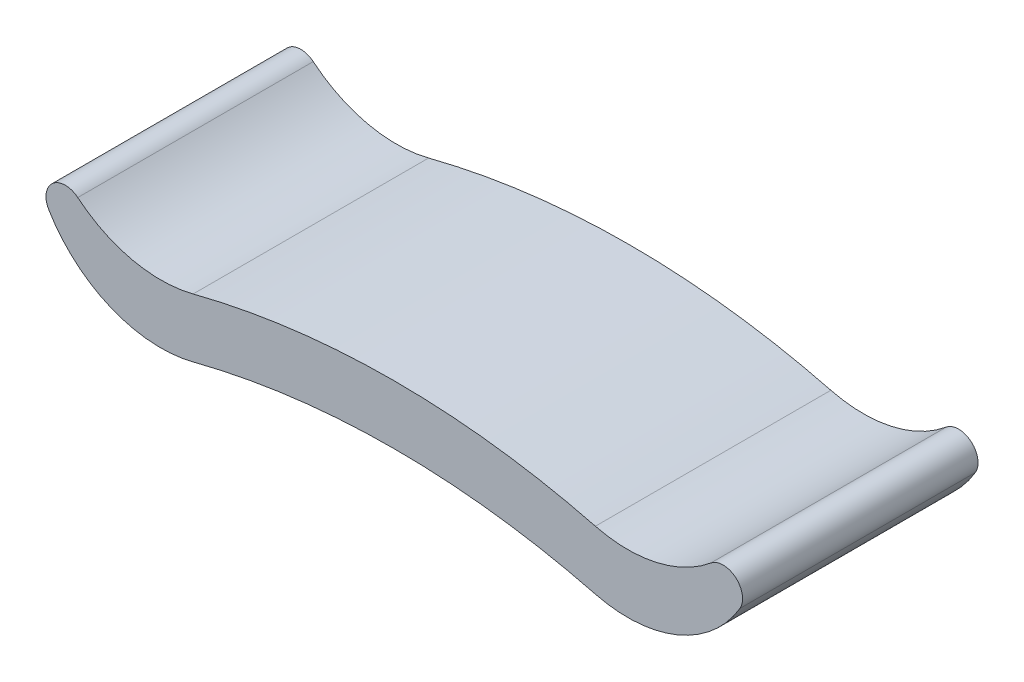
ISO-10303-21;
HEADER;
FILE_DESCRIPTION(('STEP AP214'),'2;1');
FILE_NAME('part.step','',(''),(''),'','','');
FILE_SCHEMA(('AUTOMOTIVE_DESIGN { 1 0 10303 214 1 1 1 1 }'));
ENDSEC;
DATA;
#1=APPLICATION_CONTEXT('core data for automotive mechanical design processes');
#2=APPLICATION_PROTOCOL_DEFINITION('international standard','automotive_design',2000,#1);
#3=PRODUCT_CONTEXT('',#1,'mechanical');
#4=PRODUCT('Part','Part','',(#3));
#5=PRODUCT_RELATED_PRODUCT_CATEGORY('part','',(#4));
#6=PRODUCT_DEFINITION_FORMATION('','',#4);
#7=PRODUCT_DEFINITION_CONTEXT('part definition',#1,'design');
#8=PRODUCT_DEFINITION('design','',#6,#7);
#9=PRODUCT_DEFINITION_SHAPE('','',#8);
#10=(LENGTH_UNIT() NAMED_UNIT(*) SI_UNIT(.MILLI.,.METRE.));
#11=(NAMED_UNIT(*) PLANE_ANGLE_UNIT() SI_UNIT($,.RADIAN.));
#12=(NAMED_UNIT(*) SI_UNIT($,.STERADIAN.) SOLID_ANGLE_UNIT());
#13=UNCERTAINTY_MEASURE_WITH_UNIT(LENGTH_MEASURE(1.E-05),#10,'distance_accuracy_value','');
#14=(GEOMETRIC_REPRESENTATION_CONTEXT(3) GLOBAL_UNCERTAINTY_ASSIGNED_CONTEXT((#13)) GLOBAL_UNIT_ASSIGNED_CONTEXT((#10,
#11,#12)) REPRESENTATION_CONTEXT('',''));
#15=CARTESIAN_POINT('',(0.,0.,0.));
#16=DIRECTION('',(0.,0.,1.));
#17=DIRECTION('',(1.,0.,0.));
#18=AXIS2_PLACEMENT_3D('',#15,#16,#17);
#19=CARTESIAN_POINT('',(-237.964112913794,147.815814916208,120.));
#20=DIRECTION('',(0.,0.,-1.));
#21=DIRECTION('',(-1.,0.,0.));
#22=AXIS2_PLACEMENT_3D('',#19,#20,#21);
#23=CYLINDRICAL_SURFACE('',#22,132.815814916208);
#24=CARTESIAN_POINT('',(-237.964112913794,147.815814916208,-120.));
#25=DIRECTION('',(0.,0.,1.));
#26=DIRECTION('',(1.,0.,0.));
#27=AXIS2_PLACEMENT_3D('',#24,#25,#26);
#28=CIRCLE('',#27,132.815814916208);
#29=CARTESIAN_POINT('',(-205.,19.1557669150392,-120.));
#30=VERTEX_POINT('',#29);
#31=CARTESIAN_POINT('',(-322.602575839801,45.4616685156862,-120.));
#32=VERTEX_POINT('',#31);
#33=EDGE_CURVE('E119',#30,#32,#28,.F.);
#34=ORIENTED_EDGE('',*,*,#33,.T.);
#35=DIRECTION('',(0.,0.,-1.));
#36=VECTOR('',#35,1.);
#37=CARTESIAN_POINT('',(-322.602575839801,45.4616685156862,120.));
#38=LINE('',#37,#36);
#39=CARTESIAN_POINT('',(-322.602575839801,45.4616685156862,120.));
#40=VERTEX_POINT('',#39);
#41=EDGE_CURVE('E11',#40,#32,#38,.T.);
#42=ORIENTED_EDGE('',*,*,#41,.F.);
#43=CARTESIAN_POINT('',(-237.964112913794,147.815814916208,120.));
#44=DIRECTION('',(0.,0.,1.));
#45=DIRECTION('',(1.,0.,0.));
#46=AXIS2_PLACEMENT_3D('',#43,#44,#45);
#47=CIRCLE('',#46,132.815814916208);
#48=CARTESIAN_POINT('',(-205.,19.1557669150392,120.));
#49=VERTEX_POINT('',#48);
#50=EDGE_CURVE('E143',#49,#40,#47,.F.);
#51=ORIENTED_EDGE('',*,*,#50,.F.);
#52=DIRECTION('',(0.,0.,-1.));
#53=VECTOR('',#52,1.);
#54=CARTESIAN_POINT('',(-205.,19.1557669150392,120.));
#55=LINE('',#54,#53);
#56=EDGE_CURVE('E108',#49,#30,#55,.T.);
#57=ORIENTED_EDGE('',*,*,#56,.T.);
#58=EDGE_LOOP('',(#34,#42,#51,#57));
#59=FACE_BOUND('',#58,.T.);
#60=ADVANCED_FACE('F35',(#59),#23,.F.);
#61=CARTESIAN_POINT('',(-335.212436684529,30.2124366845288,120.));
#62=DIRECTION('',(0.,0.,-1.));
#63=DIRECTION('',(-1.,0.,0.));
#64=AXIS2_PLACEMENT_3D('',#61,#62,#63);
#65=CYLINDRICAL_SURFACE('',#64,19.7875633154713);
#66=CARTESIAN_POINT('',(-335.212436684529,30.2124366845288,-120.));
#67=DIRECTION('',(0.,0.,1.));
#68=DIRECTION('',(1.,0.,0.));
#69=AXIS2_PLACEMENT_3D('',#66,#67,#68);
#70=CIRCLE('',#69,19.7875633154713);
#71=CARTESIAN_POINT('',(-352.237448897708,20.1279624243167,-120.));
#72=VERTEX_POINT('',#71);
#73=EDGE_CURVE('E152',#32,#72,#70,.T.);
#74=ORIENTED_EDGE('',*,*,#73,.T.);
#75=DIRECTION('',(0.,0.,-1.));
#76=VECTOR('',#75,1.);
#77=CARTESIAN_POINT('',(-352.237448897708,20.1279624243167,120.));
#78=LINE('',#77,#76);
#79=CARTESIAN_POINT('',(-352.237448897708,20.1279624243167,120.));
#80=VERTEX_POINT('',#79);
#81=EDGE_CURVE('E43',#80,#72,#78,.T.);
#82=ORIENTED_EDGE('',*,*,#81,.F.);
#83=CARTESIAN_POINT('',(-335.212436684529,30.2124366845288,120.));
#84=DIRECTION('',(0.,0.,1.));
#85=DIRECTION('',(1.,0.,0.));
#86=AXIS2_PLACEMENT_3D('',#83,#84,#85);
#87=CIRCLE('',#86,19.7875633154713);
#88=EDGE_CURVE('E83',#40,#80,#87,.T.);
#89=ORIENTED_EDGE('',*,*,#88,.F.);
#90=ORIENTED_EDGE('',*,*,#41,.T.);
#91=EDGE_LOOP('',(#74,#82,#89,#90));
#92=FACE_BOUND('',#91,.T.);
#93=ADVANCED_FACE('F166',(#92),#65,.T.);
#94=CARTESIAN_POINT('',(-237.964112913794,87.8158149162083,120.));
#95=DIRECTION('',(0.,0.,-1.));
#96=DIRECTION('',(-1.,0.,0.));
#97=AXIS2_PLACEMENT_3D('',#94,#95,#96);
#98=CYLINDRICAL_SURFACE('',#97,132.815814916208);
#99=CARTESIAN_POINT('',(-237.964112913794,87.8158149162083,-120.));
#100=DIRECTION('',(0.,0.,1.));
#101=DIRECTION('',(1.,0.,0.));
#102=AXIS2_PLACEMENT_3D('',#99,#100,#101);
#103=CIRCLE('',#102,132.815814916208);
#104=CARTESIAN_POINT('',(-205.,-40.844233084961,-120.));
#105=VERTEX_POINT('',#104);
#106=EDGE_CURVE('E155',#105,#72,#103,.F.);
#107=ORIENTED_EDGE('',*,*,#106,.F.);
#108=DIRECTION('',(0.,0.,-1.));
#109=VECTOR('',#108,1.);
#110=CARTESIAN_POINT('',(-205.,-40.844233084961,120.));
#111=LINE('',#110,#109);
#112=CARTESIAN_POINT('',(-205.,-40.844233084961,120.));
#113=VERTEX_POINT('',#112);
#114=EDGE_CURVE('E69',#113,#105,#111,.T.);
#115=ORIENTED_EDGE('',*,*,#114,.F.);
#116=CARTESIAN_POINT('',(-237.964112913794,87.8158149162083,120.));
#117=DIRECTION('',(0.,0.,1.));
#118=DIRECTION('',(1.,0.,0.));
#119=AXIS2_PLACEMENT_3D('',#116,#117,#118);
#120=CIRCLE('',#119,132.815814916208);
#121=EDGE_CURVE('E146',#113,#80,#120,.F.);
#122=ORIENTED_EDGE('',*,*,#121,.T.);
#123=ORIENTED_EDGE('',*,*,#81,.T.);
#124=EDGE_LOOP('',(#107,#115,#122,#123));
#125=FACE_BOUND('',#124,.T.);
#126=ADVANCED_FACE('F164',(#125),#98,.T.);
#127=CARTESIAN_POINT('',(0.,-840.966168997923,120.));
#128=DIRECTION('',(0.,0.,-1.));
#129=DIRECTION('',(-1.,0.,0.));
#130=AXIS2_PLACEMENT_3D('',#127,#128,#129);
#131=CYLINDRICAL_SURFACE('',#130,825.966168997923);
#132=CARTESIAN_POINT('',(0.,-840.966168997923,-120.));
#133=DIRECTION('',(0.,0.,1.));
#134=DIRECTION('',(1.,0.,0.));
#135=AXIS2_PLACEMENT_3D('',#132,#133,#134);
#136=CIRCLE('',#135,825.966168997923);
#137=CARTESIAN_POINT('',(205.,-40.8442330849609,-120.));
#138=VERTEX_POINT('',#137);
#139=EDGE_CURVE('E158',#138,#105,#136,.T.);
#140=ORIENTED_EDGE('',*,*,#139,.F.);
#141=DIRECTION('',(0.,0.,-1.));
#142=VECTOR('',#141,1.);
#143=CARTESIAN_POINT('',(205.,-40.8442330849609,120.));
#144=LINE('',#143,#142);
#145=CARTESIAN_POINT('',(205.,-40.8442330849609,120.));
#146=VERTEX_POINT('',#145);
#147=EDGE_CURVE('E120',#146,#138,#144,.T.);
#148=ORIENTED_EDGE('',*,*,#147,.F.);
#149=CARTESIAN_POINT('',(0.,-840.966168997923,120.));
#150=DIRECTION('',(0.,0.,1.));
#151=DIRECTION('',(1.,0.,0.));
#152=AXIS2_PLACEMENT_3D('',#149,#150,#151);
#153=CIRCLE('',#152,825.966168997923);
#154=EDGE_CURVE('E110',#146,#113,#153,.T.);
#155=ORIENTED_EDGE('',*,*,#154,.T.);
#156=ORIENTED_EDGE('',*,*,#114,.T.);
#157=EDGE_LOOP('',(#140,#148,#155,#156));
#158=FACE_BOUND('',#157,.T.);
#159=ADVANCED_FACE('F173',(#158),#131,.F.);
#160=CARTESIAN_POINT('',(0.,-780.966168997923,120.));
#161=DIRECTION('',(0.,0.,-1.));
#162=DIRECTION('',(-1.,0.,0.));
#163=AXIS2_PLACEMENT_3D('',#160,#161,#162);
#164=CYLINDRICAL_SURFACE('',#163,825.966168997923);
#165=CARTESIAN_POINT('',(0.,-780.966168997923,-120.));
#166=DIRECTION('',(0.,0.,1.));
#167=DIRECTION('',(1.,0.,0.));
#168=AXIS2_PLACEMENT_3D('',#165,#166,#167);
#169=CIRCLE('',#168,825.966168997923);
#170=CARTESIAN_POINT('',(205.,19.1557669150393,-120.));
#171=VERTEX_POINT('',#170);
#172=EDGE_CURVE('E76',#171,#30,#169,.T.);
#173=ORIENTED_EDGE('',*,*,#172,.T.);
#174=ORIENTED_EDGE('',*,*,#56,.F.);
#175=CARTESIAN_POINT('',(0.,-780.966168997923,120.));
#176=DIRECTION('',(0.,0.,1.));
#177=DIRECTION('',(1.,0.,0.));
#178=AXIS2_PLACEMENT_3D('',#175,#176,#177);
#179=CIRCLE('',#178,825.966168997923);
#180=CARTESIAN_POINT('',(205.,19.1557669150393,120.));
#181=VERTEX_POINT('',#180);
#182=EDGE_CURVE('E51',#181,#49,#179,.T.);
#183=ORIENTED_EDGE('',*,*,#182,.F.);
#184=DIRECTION('',(0.,0.,-1.));
#185=VECTOR('',#184,1.);
#186=CARTESIAN_POINT('',(205.,19.1557669150393,120.));
#187=LINE('',#186,#185);
#188=EDGE_CURVE('E106',#181,#171,#187,.T.);
#189=ORIENTED_EDGE('',*,*,#188,.T.);
#190=EDGE_LOOP('',(#173,#174,#183,#189));
#191=FACE_BOUND('',#190,.T.);
#192=ADVANCED_FACE('F105',(#191),#164,.T.);
#193=CARTESIAN_POINT('',(0.,0.,120.));
#194=DIRECTION('',(0.,0.,1.));
#195=DIRECTION('',(1.,0.,0.));
#196=AXIS2_PLACEMENT_3D('',#193,#194,#195);
#197=PLANE('',#196);
#198=ORIENTED_EDGE('',*,*,#50,.T.);
#199=ORIENTED_EDGE('',*,*,#88,.T.);
#200=ORIENTED_EDGE('',*,*,#121,.F.);
#201=ORIENTED_EDGE('',*,*,#154,.F.);
#202=CARTESIAN_POINT('',(237.964112913794,87.8158149162085,120.));
#203=DIRECTION('',(0.,0.,-1.));
#204=DIRECTION('',(-1.,0.,0.));
#205=AXIS2_PLACEMENT_3D('',#202,#203,#204);
#206=CIRCLE('',#205,132.815814916208);
#207=CARTESIAN_POINT('',(352.237448897708,20.1279624243169,120.));
#208=VERTEX_POINT('',#207);
#209=EDGE_CURVE('E125',#146,#208,#206,.F.);
#210=ORIENTED_EDGE('',*,*,#209,.T.);
#211=CARTESIAN_POINT('',(335.212436684529,30.2124366845289,120.));
#212=DIRECTION('',(0.,0.,-1.));
#213=DIRECTION('',(-1.,0.,0.));
#214=AXIS2_PLACEMENT_3D('',#211,#212,#213);
#215=CIRCLE('',#214,19.7875633154713);
#216=CARTESIAN_POINT('',(322.602575839801,45.4616685156864,120.));
#217=VERTEX_POINT('',#216);
#218=EDGE_CURVE('E124',#217,#208,#215,.T.);
#219=ORIENTED_EDGE('',*,*,#218,.F.);
#220=CARTESIAN_POINT('',(237.964112913794,147.815814916208,120.));
#221=DIRECTION('',(0.,0.,-1.));
#222=DIRECTION('',(-1.,0.,0.));
#223=AXIS2_PLACEMENT_3D('',#220,#221,#222);
#224=CIRCLE('',#223,132.815814916208);
#225=EDGE_CURVE('E115',#181,#217,#224,.F.);
#226=ORIENTED_EDGE('',*,*,#225,.F.);
#227=ORIENTED_EDGE('',*,*,#182,.T.);
#228=EDGE_LOOP('',(#198,#199,#200,#201,#210,#219,#226,#227));
#229=FACE_BOUND('',#228,.T.);
#230=ADVANCED_FACE('F122',(#229),#197,.T.);
#231=CARTESIAN_POINT('',(0.,0.,-120.));
#232=DIRECTION('',(0.,0.,1.));
#233=DIRECTION('',(1.,0.,0.));
#234=AXIS2_PLACEMENT_3D('',#231,#232,#233);
#235=PLANE('',#234);
#236=ORIENTED_EDGE('',*,*,#33,.F.);
#237=ORIENTED_EDGE('',*,*,#172,.F.);
#238=CARTESIAN_POINT('',(237.964112913794,147.815814916208,-120.));
#239=DIRECTION('',(0.,0.,-1.));
#240=DIRECTION('',(-1.,0.,0.));
#241=AXIS2_PLACEMENT_3D('',#238,#239,#240);
#242=CIRCLE('',#241,132.815814916208);
#243=CARTESIAN_POINT('',(322.602575839801,45.4616685156864,-120.));
#244=VERTEX_POINT('',#243);
#245=EDGE_CURVE('E118',#171,#244,#242,.F.);
#246=ORIENTED_EDGE('',*,*,#245,.T.);
#247=CARTESIAN_POINT('',(335.212436684529,30.2124366845289,-120.));
#248=DIRECTION('',(0.,0.,-1.));
#249=DIRECTION('',(-1.,0.,0.));
#250=AXIS2_PLACEMENT_3D('',#247,#248,#249);
#251=CIRCLE('',#250,19.7875633154713);
#252=CARTESIAN_POINT('',(352.237448897708,20.1279624243169,-120.));
#253=VERTEX_POINT('',#252);
#254=EDGE_CURVE('E126',#244,#253,#251,.T.);
#255=ORIENTED_EDGE('',*,*,#254,.T.);
#256=CARTESIAN_POINT('',(237.964112913794,87.8158149162085,-120.));
#257=DIRECTION('',(0.,0.,-1.));
#258=DIRECTION('',(-1.,0.,0.));
#259=AXIS2_PLACEMENT_3D('',#256,#257,#258);
#260=CIRCLE('',#259,132.815814916208);
#261=EDGE_CURVE('E130',#138,#253,#260,.F.);
#262=ORIENTED_EDGE('',*,*,#261,.F.);
#263=ORIENTED_EDGE('',*,*,#139,.T.);
#264=ORIENTED_EDGE('',*,*,#106,.T.);
#265=ORIENTED_EDGE('',*,*,#73,.F.);
#266=EDGE_LOOP('',(#236,#237,#246,#255,#262,#263,#264,#265));
#267=FACE_BOUND('',#266,.T.);
#268=ADVANCED_FACE('F170',(#267),#235,.F.);
#269=CARTESIAN_POINT('',(237.964112913794,147.815814916208,120.));
#270=DIRECTION('',(0.,0.,-1.));
#271=DIRECTION('',(-1.,0.,0.));
#272=AXIS2_PLACEMENT_3D('',#269,#270,#271);
#273=CYLINDRICAL_SURFACE('',#272,132.815814916208);
#274=ORIENTED_EDGE('',*,*,#245,.F.);
#275=ORIENTED_EDGE('',*,*,#188,.F.);
#276=ORIENTED_EDGE('',*,*,#225,.T.);
#277=DIRECTION('',(0.,0.,-1.));
#278=VECTOR('',#277,1.);
#279=CARTESIAN_POINT('',(322.602575839801,45.4616685156864,120.));
#280=LINE('',#279,#278);
#281=EDGE_CURVE('E134',#217,#244,#280,.T.);
#282=ORIENTED_EDGE('',*,*,#281,.T.);
#283=EDGE_LOOP('',(#274,#275,#276,#282));
#284=FACE_BOUND('',#283,.T.);
#285=ADVANCED_FACE('F114',(#284),#273,.F.);
#286=CARTESIAN_POINT('',(237.964112913794,87.8158149162085,120.));
#287=DIRECTION('',(0.,0.,-1.));
#288=DIRECTION('',(-1.,0.,0.));
#289=AXIS2_PLACEMENT_3D('',#286,#287,#288);
#290=CYLINDRICAL_SURFACE('',#289,132.815814916208);
#291=ORIENTED_EDGE('',*,*,#261,.T.);
#292=DIRECTION('',(0.,0.,-1.));
#293=VECTOR('',#292,1.);
#294=CARTESIAN_POINT('',(352.237448897708,20.1279624243169,120.));
#295=LINE('',#294,#293);
#296=EDGE_CURVE('E139',#208,#253,#295,.T.);
#297=ORIENTED_EDGE('',*,*,#296,.F.);
#298=ORIENTED_EDGE('',*,*,#209,.F.);
#299=ORIENTED_EDGE('',*,*,#147,.T.);
#300=EDGE_LOOP('',(#291,#297,#298,#299));
#301=FACE_BOUND('',#300,.T.);
#302=ADVANCED_FACE('F176',(#301),#290,.T.);
#303=CARTESIAN_POINT('',(335.212436684529,30.2124366845289,120.));
#304=DIRECTION('',(0.,0.,-1.));
#305=DIRECTION('',(-1.,0.,0.));
#306=AXIS2_PLACEMENT_3D('',#303,#304,#305);
#307=CYLINDRICAL_SURFACE('',#306,19.7875633154713);
#308=ORIENTED_EDGE('',*,*,#254,.F.);
#309=ORIENTED_EDGE('',*,*,#281,.F.);
#310=ORIENTED_EDGE('',*,*,#218,.T.);
#311=ORIENTED_EDGE('',*,*,#296,.T.);
#312=EDGE_LOOP('',(#308,#309,#310,#311));
#313=FACE_BOUND('',#312,.T.);
#314=ADVANCED_FACE('F181',(#313),#307,.T.);
#315=CLOSED_SHELL('',(#60,#93,#126,#159,#192,#230,#268,#285,#302,#314));
#316=MANIFOLD_SOLID_BREP('B2',#315);
#317=ADVANCED_BREP_SHAPE_REPRESENTATION('',(#18,#316),#14);
#318=SHAPE_DEFINITION_REPRESENTATION(#9,#317);
ENDSEC;
END-ISO-10303-21;
